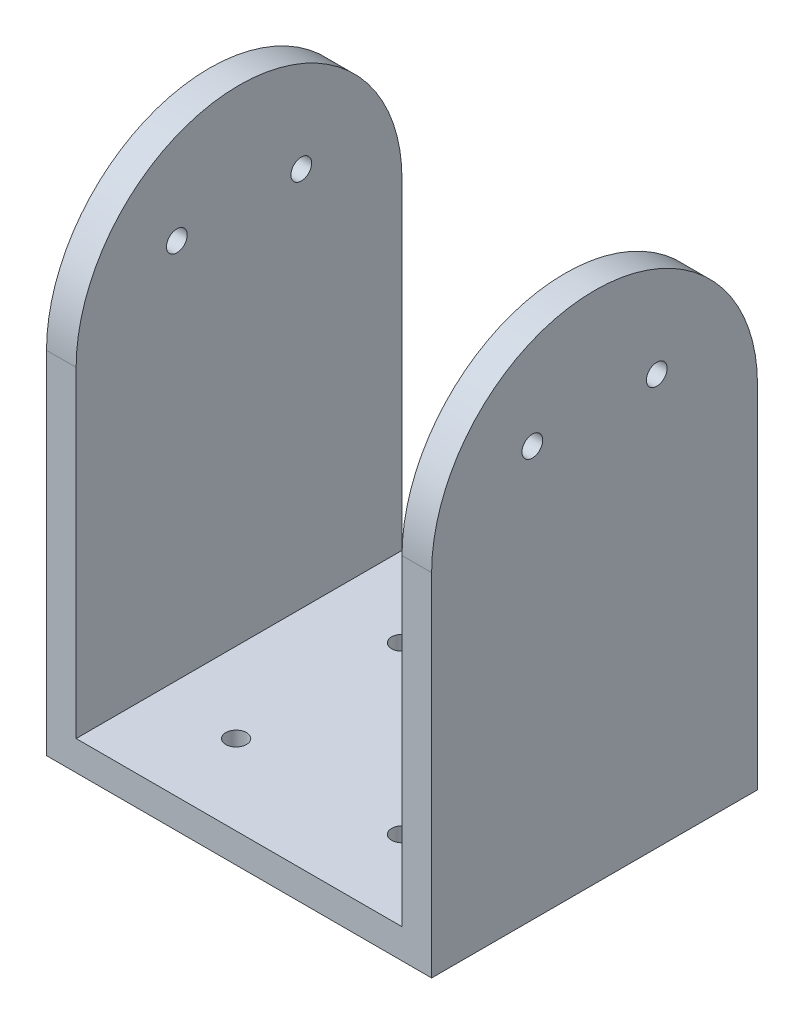
ISO-10303-21;
HEADER;
FILE_DESCRIPTION(('STEP AP214'),'2;1');
FILE_NAME('part.step','',(''),(''),'','','');
FILE_SCHEMA(('AUTOMOTIVE_DESIGN { 1 0 10303 214 1 1 1 1 }'));
ENDSEC;
DATA;
#1=APPLICATION_CONTEXT('core data for automotive mechanical design processes');
#2=APPLICATION_PROTOCOL_DEFINITION('international standard','automotive_design',2000,#1);
#3=PRODUCT_CONTEXT('',#1,'mechanical');
#4=PRODUCT('Part','Part','',(#3));
#5=PRODUCT_RELATED_PRODUCT_CATEGORY('part','',(#4));
#6=PRODUCT_DEFINITION_FORMATION('','',#4);
#7=PRODUCT_DEFINITION_CONTEXT('part definition',#1,'design');
#8=PRODUCT_DEFINITION('design','',#6,#7);
#9=PRODUCT_DEFINITION_SHAPE('','',#8);
#10=(LENGTH_UNIT() NAMED_UNIT(*) SI_UNIT(.MILLI.,.METRE.));
#11=(NAMED_UNIT(*) PLANE_ANGLE_UNIT() SI_UNIT($,.RADIAN.));
#12=(NAMED_UNIT(*) SI_UNIT($,.STERADIAN.) SOLID_ANGLE_UNIT());
#13=UNCERTAINTY_MEASURE_WITH_UNIT(LENGTH_MEASURE(1.E-05),#10,'distance_accuracy_value','');
#14=(GEOMETRIC_REPRESENTATION_CONTEXT(3) GLOBAL_UNCERTAINTY_ASSIGNED_CONTEXT((#13)) GLOBAL_UNIT_ASSIGNED_CONTEXT((#10,
#11,#12)) REPRESENTATION_CONTEXT('',''));
#15=CARTESIAN_POINT('',(0.,0.,0.));
#16=DIRECTION('',(0.,0.,1.));
#17=DIRECTION('',(1.,0.,0.));
#18=AXIS2_PLACEMENT_3D('',#15,#16,#17);
#19=CARTESIAN_POINT('',(32.5,5.,27.5));
#20=DIRECTION('',(-1.,0.,0.));
#21=DIRECTION('',(0.,0.,1.));
#22=AXIS2_PLACEMENT_3D('',#19,#20,#21);
#23=PLANE('',#22);
#24=CARTESIAN_POINT('',(32.5,69.25,10.5));
#25=DIRECTION('',(-1.,0.,0.));
#26=DIRECTION('',(0.,0.,1.));
#27=AXIS2_PLACEMENT_3D('',#24,#25,#26);
#28=CIRCLE('',#27,1.75);
#29=CARTESIAN_POINT('',(32.5,69.25,12.25));
#30=VERTEX_POINT('',#29);
#31=EDGE_CURVE('E243',#30,#30,#28,.F.);
#32=ORIENTED_EDGE('',*,*,#31,.F.);
#33=EDGE_LOOP('',(#32));
#34=FACE_BOUND('',#33,.T.);
#35=CARTESIAN_POINT('',(32.5,59.25,0.));
#36=DIRECTION('',(-1.,0.,0.));
#37=DIRECTION('',(0.,0.,1.));
#38=AXIS2_PLACEMENT_3D('',#35,#36,#37);
#39=CIRCLE('',#38,27.5);
#40=CARTESIAN_POINT('',(32.5,59.25,-27.5));
#41=VERTEX_POINT('',#40);
#42=CARTESIAN_POINT('',(32.5,59.25,27.5));
#43=VERTEX_POINT('',#42);
#44=EDGE_CURVE('E150',#41,#43,#39,.F.);
#45=ORIENTED_EDGE('',*,*,#44,.T.);
#46=DIRECTION('',(0.,-1.,0.));
#47=VECTOR('',#46,1.);
#48=CARTESIAN_POINT('',(32.5,5.,27.5));
#49=LINE('',#48,#47);
#50=CARTESIAN_POINT('',(32.5,0.,27.5));
#51=VERTEX_POINT('',#50);
#52=EDGE_CURVE('E155',#43,#51,#49,.T.);
#53=ORIENTED_EDGE('',*,*,#52,.T.);
#54=DIRECTION('',(0.,0.,-1.));
#55=VECTOR('',#54,1.);
#56=CARTESIAN_POINT('',(32.5,0.,27.5));
#57=LINE('',#56,#55);
#58=CARTESIAN_POINT('',(32.5,0.,-27.5));
#59=VERTEX_POINT('',#58);
#60=EDGE_CURVE('E195',#51,#59,#57,.T.);
#61=ORIENTED_EDGE('',*,*,#60,.T.);
#62=DIRECTION('',(0.,-1.,0.));
#63=VECTOR('',#62,1.);
#64=CARTESIAN_POINT('',(32.5,5.,-27.5));
#65=LINE('',#64,#63);
#66=EDGE_CURVE('E12',#41,#59,#65,.T.);
#67=ORIENTED_EDGE('',*,*,#66,.F.);
#68=EDGE_LOOP('',(#45,#53,#61,#67));
#69=FACE_BOUND('',#68,.T.);
#70=CARTESIAN_POINT('',(32.5,69.25,-10.5));
#71=DIRECTION('',(-1.,0.,0.));
#72=DIRECTION('',(0.,0.,1.));
#73=AXIS2_PLACEMENT_3D('',#70,#71,#72);
#74=CIRCLE('',#73,1.75);
#75=CARTESIAN_POINT('',(32.5,69.25,-8.75));
#76=VERTEX_POINT('',#75);
#77=EDGE_CURVE('E164',#76,#76,#74,.T.);
#78=ORIENTED_EDGE('',*,*,#77,.T.);
#79=EDGE_LOOP('',(#78));
#80=FACE_BOUND('',#79,.T.);
#81=ADVANCED_FACE('F84',(#34,#69,#80),#23,.F.);
#82=CARTESIAN_POINT('',(27.5,86.75,-27.5));
#83=DIRECTION('',(1.,0.,0.));
#84=DIRECTION('',(0.,0.,-1.));
#85=AXIS2_PLACEMENT_3D('',#82,#83,#84);
#86=PLANE('',#85);
#87=CARTESIAN_POINT('',(27.5,69.25,10.5));
#88=DIRECTION('',(1.,0.,0.));
#89=DIRECTION('',(0.,0.,-1.));
#90=AXIS2_PLACEMENT_3D('',#87,#88,#89);
#91=CIRCLE('',#90,1.75);
#92=CARTESIAN_POINT('',(27.5,69.25,8.75000000000001));
#93=VERTEX_POINT('',#92);
#94=EDGE_CURVE('E238',#93,#93,#91,.F.);
#95=ORIENTED_EDGE('',*,*,#94,.F.);
#96=EDGE_LOOP('',(#95));
#97=FACE_BOUND('',#96,.T.);
#98=DIRECTION('',(0.,-1.,0.));
#99=VECTOR('',#98,1.);
#100=CARTESIAN_POINT('',(27.5,86.75,27.5));
#101=LINE('',#100,#99);
#102=CARTESIAN_POINT('',(27.5,59.25,27.5));
#103=VERTEX_POINT('',#102);
#104=CARTESIAN_POINT('',(27.5,5.,27.5));
#105=VERTEX_POINT('',#104);
#106=EDGE_CURVE('E106',#103,#105,#101,.T.);
#107=ORIENTED_EDGE('',*,*,#106,.F.);
#108=CARTESIAN_POINT('',(27.5,59.25,0.));
#109=DIRECTION('',(1.,0.,0.));
#110=DIRECTION('',(0.,0.,-1.));
#111=AXIS2_PLACEMENT_3D('',#108,#109,#110);
#112=CIRCLE('',#111,27.5);
#113=CARTESIAN_POINT('',(27.5,59.25,-27.5));
#114=VERTEX_POINT('',#113);
#115=EDGE_CURVE('E160',#103,#114,#112,.F.);
#116=ORIENTED_EDGE('',*,*,#115,.T.);
#117=DIRECTION('',(0.,-1.,0.));
#118=VECTOR('',#117,1.);
#119=CARTESIAN_POINT('',(27.5,86.75,-27.5));
#120=LINE('',#119,#118);
#121=CARTESIAN_POINT('',(27.5,5.,-27.5));
#122=VERTEX_POINT('',#121);
#123=EDGE_CURVE('E98',#114,#122,#120,.T.);
#124=ORIENTED_EDGE('',*,*,#123,.T.);
#125=DIRECTION('',(0.,0.,1.));
#126=VECTOR('',#125,1.);
#127=CARTESIAN_POINT('',(27.5,5.,-27.5));
#128=LINE('',#127,#126);
#129=EDGE_CURVE('E211',#122,#105,#128,.T.);
#130=ORIENTED_EDGE('',*,*,#129,.T.);
#131=EDGE_LOOP('',(#107,#116,#124,#130));
#132=FACE_BOUND('',#131,.T.);
#133=CARTESIAN_POINT('',(27.5,69.25,-10.5));
#134=DIRECTION('',(1.,0.,0.));
#135=DIRECTION('',(0.,0.,-1.));
#136=AXIS2_PLACEMENT_3D('',#133,#134,#135);
#137=CIRCLE('',#136,1.75);
#138=CARTESIAN_POINT('',(27.5,69.25,-12.25));
#139=VERTEX_POINT('',#138);
#140=EDGE_CURVE('E235',#139,#139,#137,.T.);
#141=ORIENTED_EDGE('',*,*,#140,.T.);
#142=EDGE_LOOP('',(#141));
#143=FACE_BOUND('',#142,.T.);
#144=ADVANCED_FACE('F313',(#97,#132,#143),#86,.F.);
#145=CARTESIAN_POINT('',(-32.5,5.,27.5));
#146=DIRECTION('',(0.,0.,-1.));
#147=DIRECTION('',(-1.,0.,0.));
#148=AXIS2_PLACEMENT_3D('',#145,#146,#147);
#149=PLANE('',#148);
#150=DIRECTION('',(1.,0.,0.));
#151=VECTOR('',#150,1.);
#152=CARTESIAN_POINT('',(-32.501,59.25,27.5));
#153=LINE('',#152,#151);
#154=EDGE_CURVE('E162',#103,#43,#153,.T.);
#155=ORIENTED_EDGE('',*,*,#154,.F.);
#156=ORIENTED_EDGE('',*,*,#106,.T.);
#157=DIRECTION('',(1.,0.,0.));
#158=VECTOR('',#157,1.);
#159=CARTESIAN_POINT('',(-32.5,5.,27.5));
#160=LINE('',#159,#158);
#161=CARTESIAN_POINT('',(-27.5,5.,27.5));
#162=VERTEX_POINT('',#161);
#163=EDGE_CURVE('E171',#162,#105,#160,.T.);
#164=ORIENTED_EDGE('',*,*,#163,.F.);
#165=DIRECTION('',(0.,-1.,0.));
#166=VECTOR('',#165,1.);
#167=CARTESIAN_POINT('',(-27.5,86.75,27.5));
#168=LINE('',#167,#166);
#169=CARTESIAN_POINT('',(-27.5,59.25,27.5));
#170=VERTEX_POINT('',#169);
#171=EDGE_CURVE('E199',#170,#162,#168,.T.);
#172=ORIENTED_EDGE('',*,*,#171,.F.);
#173=DIRECTION('',(-1.,0.,0.));
#174=VECTOR('',#173,1.);
#175=CARTESIAN_POINT('',(32.501,59.25,27.5));
#176=LINE('',#175,#174);
#177=CARTESIAN_POINT('',(-32.5,59.25,27.5));
#178=VERTEX_POINT('',#177);
#179=EDGE_CURVE('E218',#170,#178,#176,.T.);
#180=ORIENTED_EDGE('',*,*,#179,.T.);
#181=DIRECTION('',(0.,-1.,0.));
#182=VECTOR('',#181,1.);
#183=CARTESIAN_POINT('',(-32.5,5.,27.5));
#184=LINE('',#183,#182);
#185=CARTESIAN_POINT('',(-32.5,0.,27.5));
#186=VERTEX_POINT('',#185);
#187=EDGE_CURVE('E170',#178,#186,#184,.T.);
#188=ORIENTED_EDGE('',*,*,#187,.T.);
#189=DIRECTION('',(1.,0.,0.));
#190=VECTOR('',#189,1.);
#191=CARTESIAN_POINT('',(-32.5,0.,27.5));
#192=LINE('',#191,#190);
#193=EDGE_CURVE('E168',#186,#51,#192,.T.);
#194=ORIENTED_EDGE('',*,*,#193,.T.);
#195=ORIENTED_EDGE('',*,*,#52,.F.);
#196=EDGE_LOOP('',(#155,#156,#164,#172,#180,#188,#194,#195));
#197=FACE_BOUND('',#196,.T.);
#198=ADVANCED_FACE('F166',(#197),#149,.F.);
#199=CARTESIAN_POINT('',(-32.5,5.,27.5));
#200=DIRECTION('',(1.,0.,0.));
#201=DIRECTION('',(0.,0.,-1.));
#202=AXIS2_PLACEMENT_3D('',#199,#200,#201);
#203=PLANE('',#202);
#204=CARTESIAN_POINT('',(-32.5,69.25,10.5));
#205=DIRECTION('',(-1.,0.,0.));
#206=DIRECTION('',(0.,0.,1.));
#207=AXIS2_PLACEMENT_3D('',#204,#205,#206);
#208=CIRCLE('',#207,1.75);
#209=CARTESIAN_POINT('',(-32.5,69.25,12.25));
#210=VERTEX_POINT('',#209);
#211=EDGE_CURVE('E228',#210,#210,#208,.F.);
#212=ORIENTED_EDGE('',*,*,#211,.T.);
#213=EDGE_LOOP('',(#212));
#214=FACE_BOUND('',#213,.T.);
#215=ORIENTED_EDGE('',*,*,#187,.F.);
#216=CARTESIAN_POINT('',(-32.5,59.25,0.));
#217=DIRECTION('',(-1.,0.,0.));
#218=DIRECTION('',(0.,0.,1.));
#219=AXIS2_PLACEMENT_3D('',#216,#217,#218);
#220=CIRCLE('',#219,27.5);
#221=CARTESIAN_POINT('',(-32.5,59.25,-27.5));
#222=VERTEX_POINT('',#221);
#223=EDGE_CURVE('E188',#222,#178,#220,.F.);
#224=ORIENTED_EDGE('',*,*,#223,.F.);
#225=DIRECTION('',(0.,-1.,0.));
#226=VECTOR('',#225,1.);
#227=CARTESIAN_POINT('',(-32.5,5.,-27.5));
#228=LINE('',#227,#226);
#229=CARTESIAN_POINT('',(-32.5,0.,-27.5));
#230=VERTEX_POINT('',#229);
#231=EDGE_CURVE('E91',#222,#230,#228,.T.);
#232=ORIENTED_EDGE('',*,*,#231,.T.);
#233=DIRECTION('',(0.,0.,1.));
#234=VECTOR('',#233,1.);
#235=CARTESIAN_POINT('',(-32.5,0.,27.5));
#236=LINE('',#235,#234);
#237=EDGE_CURVE('E187',#230,#186,#236,.T.);
#238=ORIENTED_EDGE('',*,*,#237,.T.);
#239=EDGE_LOOP('',(#215,#224,#232,#238));
#240=FACE_BOUND('',#239,.T.);
#241=CARTESIAN_POINT('',(-32.5,69.25,-10.5));
#242=DIRECTION('',(-1.,0.,0.));
#243=DIRECTION('',(0.,0.,1.));
#244=AXIS2_PLACEMENT_3D('',#241,#242,#243);
#245=CIRCLE('',#244,1.75);
#246=CARTESIAN_POINT('',(-32.5,69.25,-8.75));
#247=VERTEX_POINT('',#246);
#248=EDGE_CURVE('E222',#247,#247,#245,.T.);
#249=ORIENTED_EDGE('',*,*,#248,.F.);
#250=EDGE_LOOP('',(#249));
#251=FACE_BOUND('',#250,.T.);
#252=ADVANCED_FACE('F184',(#214,#240,#251),#203,.F.);
#253=CARTESIAN_POINT('',(-27.5,86.75,-27.5));
#254=DIRECTION('',(-1.,0.,0.));
#255=DIRECTION('',(0.,0.,1.));
#256=AXIS2_PLACEMENT_3D('',#253,#254,#255);
#257=PLANE('',#256);
#258=CARTESIAN_POINT('',(-27.5,69.25,10.5));
#259=DIRECTION('',(-1.,0.,0.));
#260=DIRECTION('',(0.,0.,1.));
#261=AXIS2_PLACEMENT_3D('',#258,#259,#260);
#262=CIRCLE('',#261,1.75);
#263=CARTESIAN_POINT('',(-27.5,69.25,12.25));
#264=VERTEX_POINT('',#263);
#265=EDGE_CURVE('E225',#264,#264,#262,.T.);
#266=ORIENTED_EDGE('',*,*,#265,.T.);
#267=EDGE_LOOP('',(#266));
#268=FACE_BOUND('',#267,.T.);
#269=CARTESIAN_POINT('',(-27.5,59.25,0.));
#270=DIRECTION('',(-1.,0.,0.));
#271=DIRECTION('',(0.,0.,1.));
#272=AXIS2_PLACEMENT_3D('',#269,#270,#271);
#273=CIRCLE('',#272,27.5);
#274=CARTESIAN_POINT('',(-27.5,59.25,-27.5));
#275=VERTEX_POINT('',#274);
#276=EDGE_CURVE('E213',#170,#275,#273,.T.);
#277=ORIENTED_EDGE('',*,*,#276,.F.);
#278=ORIENTED_EDGE('',*,*,#171,.T.);
#279=DIRECTION('',(0.,0.,-1.));
#280=VECTOR('',#279,1.);
#281=CARTESIAN_POINT('',(-27.5,5.,-27.5));
#282=LINE('',#281,#280);
#283=CARTESIAN_POINT('',(-27.5,5.,-27.5));
#284=VERTEX_POINT('',#283);
#285=EDGE_CURVE('E206',#162,#284,#282,.T.);
#286=ORIENTED_EDGE('',*,*,#285,.T.);
#287=DIRECTION('',(0.,-1.,0.));
#288=VECTOR('',#287,1.);
#289=CARTESIAN_POINT('',(-27.5,86.75,-27.5));
#290=LINE('',#289,#288);
#291=EDGE_CURVE('E204',#275,#284,#290,.T.);
#292=ORIENTED_EDGE('',*,*,#291,.F.);
#293=EDGE_LOOP('',(#277,#278,#286,#292));
#294=FACE_BOUND('',#293,.T.);
#295=CARTESIAN_POINT('',(-27.5,69.25,-10.5));
#296=DIRECTION('',(-1.,0.,0.));
#297=DIRECTION('',(0.,0.,1.));
#298=AXIS2_PLACEMENT_3D('',#295,#296,#297);
#299=CIRCLE('',#298,1.75);
#300=CARTESIAN_POINT('',(-27.5,69.25,-8.75));
#301=VERTEX_POINT('',#300);
#302=EDGE_CURVE('E219',#301,#301,#299,.F.);
#303=ORIENTED_EDGE('',*,*,#302,.F.);
#304=EDGE_LOOP('',(#303));
#305=FACE_BOUND('',#304,.T.);
#306=ADVANCED_FACE('F291',(#268,#294,#305),#257,.F.);
#307=CARTESIAN_POINT('',(0.,5.,0.));
#308=DIRECTION('',(0.,-1.,0.));
#309=DIRECTION('',(0.,0.,-1.));
#310=AXIS2_PLACEMENT_3D('',#307,#308,#309);
#311=PLANE('',#310);
#312=CARTESIAN_POINT('',(14.0000000000002,5.,14.));
#313=DIRECTION('',(0.,-1.,0.));
#314=DIRECTION('',(0.,0.,-1.));
#315=AXIS2_PLACEMENT_3D('',#312,#313,#314);
#316=CIRCLE('',#315,1.75);
#317=CARTESIAN_POINT('',(14.0000000000002,5.,12.25));
#318=VERTEX_POINT('',#317);
#319=EDGE_CURVE('E253',#318,#318,#316,.F.);
#320=ORIENTED_EDGE('',*,*,#319,.F.);
#321=EDGE_LOOP('',(#320));
#322=FACE_BOUND('',#321,.T.);
#323=CARTESIAN_POINT('',(14.0000000000002,5.,-14.));
#324=DIRECTION('',(0.,-1.,0.));
#325=DIRECTION('',(0.,0.,-1.));
#326=AXIS2_PLACEMENT_3D('',#323,#324,#325);
#327=CIRCLE('',#326,1.75);
#328=CARTESIAN_POINT('',(14.0000000000002,5.,-15.75));
#329=VERTEX_POINT('',#328);
#330=EDGE_CURVE('E260',#329,#329,#327,.F.);
#331=ORIENTED_EDGE('',*,*,#330,.F.);
#332=EDGE_LOOP('',(#331));
#333=FACE_BOUND('',#332,.T.);
#334=CARTESIAN_POINT('',(-14.0000000000002,5.,-14.));
#335=DIRECTION('',(0.,-1.,0.));
#336=DIRECTION('',(0.,0.,-1.));
#337=AXIS2_PLACEMENT_3D('',#334,#335,#336);
#338=CIRCLE('',#337,1.75);
#339=CARTESIAN_POINT('',(-14.0000000000002,5.,-15.75));
#340=VERTEX_POINT('',#339);
#341=EDGE_CURVE('E252',#340,#340,#338,.F.);
#342=ORIENTED_EDGE('',*,*,#341,.F.);
#343=EDGE_LOOP('',(#342));
#344=FACE_BOUND('',#343,.T.);
#345=CARTESIAN_POINT('',(-14.0000000000002,5.,14.));
#346=DIRECTION('',(0.,-1.,0.));
#347=DIRECTION('',(0.,0.,-1.));
#348=AXIS2_PLACEMENT_3D('',#345,#346,#347);
#349=CIRCLE('',#348,1.75);
#350=CARTESIAN_POINT('',(-14.0000000000002,5.,12.25));
#351=VERTEX_POINT('',#350);
#352=EDGE_CURVE('E246',#351,#351,#349,.F.);
#353=ORIENTED_EDGE('',*,*,#352,.F.);
#354=EDGE_LOOP('',(#353));
#355=FACE_BOUND('',#354,.T.);
#356=ORIENTED_EDGE('',*,*,#129,.F.);
#357=DIRECTION('',(-1.,0.,0.));
#358=VECTOR('',#357,1.);
#359=CARTESIAN_POINT('',(-32.5,5.,-27.5));
#360=LINE('',#359,#358);
#361=EDGE_CURVE('E174',#122,#284,#360,.T.);
#362=ORIENTED_EDGE('',*,*,#361,.T.);
#363=ORIENTED_EDGE('',*,*,#285,.F.);
#364=ORIENTED_EDGE('',*,*,#163,.T.);
#365=EDGE_LOOP('',(#356,#362,#363,#364));
#366=FACE_BOUND('',#365,.T.);
#367=ADVANCED_FACE('F288',(#322,#333,#344,#355,#366),#311,.F.);
#368=CARTESIAN_POINT('',(-32.5,5.,-27.5));
#369=DIRECTION('',(0.,0.,1.));
#370=DIRECTION('',(1.,0.,0.));
#371=AXIS2_PLACEMENT_3D('',#368,#369,#370);
#372=PLANE('',#371);
#373=ORIENTED_EDGE('',*,*,#123,.F.);
#374=DIRECTION('',(1.,0.,0.));
#375=VECTOR('',#374,1.);
#376=CARTESIAN_POINT('',(-32.501,59.25,-27.5));
#377=LINE('',#376,#375);
#378=EDGE_CURVE('E159',#114,#41,#377,.T.);
#379=ORIENTED_EDGE('',*,*,#378,.T.);
#380=ORIENTED_EDGE('',*,*,#66,.T.);
#381=DIRECTION('',(-1.,0.,0.));
#382=VECTOR('',#381,1.);
#383=CARTESIAN_POINT('',(-32.5,0.,-27.5));
#384=LINE('',#383,#382);
#385=EDGE_CURVE('E192',#59,#230,#384,.T.);
#386=ORIENTED_EDGE('',*,*,#385,.T.);
#387=ORIENTED_EDGE('',*,*,#231,.F.);
#388=DIRECTION('',(-1.,0.,0.));
#389=VECTOR('',#388,1.);
#390=CARTESIAN_POINT('',(32.501,59.25,-27.5));
#391=LINE('',#390,#389);
#392=EDGE_CURVE('E215',#275,#222,#391,.T.);
#393=ORIENTED_EDGE('',*,*,#392,.F.);
#394=ORIENTED_EDGE('',*,*,#291,.T.);
#395=ORIENTED_EDGE('',*,*,#361,.F.);
#396=EDGE_LOOP('',(#373,#379,#380,#386,#387,#393,#394,#395));
#397=FACE_BOUND('',#396,.T.);
#398=ADVANCED_FACE('F193',(#397),#372,.F.);
#399=CARTESIAN_POINT('',(0.,0.,0.));
#400=DIRECTION('',(0.,-1.,0.));
#401=DIRECTION('',(0.,0.,-1.));
#402=AXIS2_PLACEMENT_3D('',#399,#400,#401);
#403=PLANE('',#402);
#404=CARTESIAN_POINT('',(14.0000000000002,0.,14.));
#405=DIRECTION('',(0.,-1.,0.));
#406=DIRECTION('',(0.,0.,1.));
#407=AXIS2_PLACEMENT_3D('',#404,#405,#406);
#408=CIRCLE('',#407,1.75);
#409=CARTESIAN_POINT('',(14.0000000000002,0.,12.25));
#410=VERTEX_POINT('',#409);
#411=EDGE_CURVE('E257',#410,#410,#408,.T.);
#412=ORIENTED_EDGE('',*,*,#411,.F.);
#413=EDGE_LOOP('',(#412));
#414=FACE_BOUND('',#413,.T.);
#415=CARTESIAN_POINT('',(14.0000000000002,0.,-14.));
#416=DIRECTION('',(0.,-1.,0.));
#417=DIRECTION('',(0.,0.,-1.));
#418=AXIS2_PLACEMENT_3D('',#415,#416,#417);
#419=CIRCLE('',#418,1.75);
#420=CARTESIAN_POINT('',(14.0000000000002,0.,-15.75));
#421=VERTEX_POINT('',#420);
#422=EDGE_CURVE('E256',#421,#421,#419,.T.);
#423=ORIENTED_EDGE('',*,*,#422,.F.);
#424=EDGE_LOOP('',(#423));
#425=FACE_BOUND('',#424,.T.);
#426=CARTESIAN_POINT('',(-14.0000000000002,0.,-14.));
#427=DIRECTION('',(0.,-1.,0.));
#428=DIRECTION('',(0.,0.,1.));
#429=AXIS2_PLACEMENT_3D('',#426,#427,#428);
#430=CIRCLE('',#429,1.75);
#431=CARTESIAN_POINT('',(-14.0000000000002,0.,-15.75));
#432=VERTEX_POINT('',#431);
#433=EDGE_CURVE('E263',#432,#432,#430,.T.);
#434=ORIENTED_EDGE('',*,*,#433,.F.);
#435=EDGE_LOOP('',(#434));
#436=FACE_BOUND('',#435,.T.);
#437=CARTESIAN_POINT('',(-14.0000000000002,0.,14.));
#438=DIRECTION('',(0.,-1.,0.));
#439=DIRECTION('',(0.,0.,-1.));
#440=AXIS2_PLACEMENT_3D('',#437,#438,#439);
#441=CIRCLE('',#440,1.75);
#442=CARTESIAN_POINT('',(-14.0000000000002,0.,12.25));
#443=VERTEX_POINT('',#442);
#444=EDGE_CURVE('E249',#443,#443,#441,.T.);
#445=ORIENTED_EDGE('',*,*,#444,.F.);
#446=EDGE_LOOP('',(#445));
#447=FACE_BOUND('',#446,.T.);
#448=ORIENTED_EDGE('',*,*,#60,.F.);
#449=ORIENTED_EDGE('',*,*,#193,.F.);
#450=ORIENTED_EDGE('',*,*,#237,.F.);
#451=ORIENTED_EDGE('',*,*,#385,.F.);
#452=EDGE_LOOP('',(#448,#449,#450,#451));
#453=FACE_BOUND('',#452,.T.);
#454=ADVANCED_FACE('F197',(#414,#425,#436,#447,#453),#403,.T.);
#455=CARTESIAN_POINT('',(32.501,59.25,0.));
#456=DIRECTION('',(-1.,0.,0.));
#457=DIRECTION('',(0.,0.,1.));
#458=AXIS2_PLACEMENT_3D('',#455,#456,#457);
#459=CYLINDRICAL_SURFACE('',#458,27.5);
#460=ORIENTED_EDGE('',*,*,#276,.T.);
#461=ORIENTED_EDGE('',*,*,#392,.T.);
#462=ORIENTED_EDGE('',*,*,#223,.T.);
#463=ORIENTED_EDGE('',*,*,#179,.F.);
#464=EDGE_LOOP('',(#460,#461,#462,#463));
#465=FACE_BOUND('',#464,.T.);
#466=ADVANCED_FACE('F276',(#465),#459,.T.);
#467=CARTESIAN_POINT('',(32.501,69.25,-10.5));
#468=DIRECTION('',(-1.,0.,0.));
#469=DIRECTION('',(0.,0.,1.));
#470=AXIS2_PLACEMENT_3D('',#467,#468,#469);
#471=CYLINDRICAL_SURFACE('',#470,1.75);
#472=ORIENTED_EDGE('',*,*,#248,.T.);
#473=EDGE_LOOP('',(#472));
#474=FACE_BOUND('',#473,.T.);
#475=ORIENTED_EDGE('',*,*,#302,.T.);
#476=EDGE_LOOP('',(#475));
#477=FACE_BOUND('',#476,.T.);
#478=ADVANCED_FACE('F303',(#474,#477),#471,.F.);
#479=CARTESIAN_POINT('',(32.501,69.25,10.5));
#480=DIRECTION('',(-1.,0.,0.));
#481=DIRECTION('',(0.,0.,1.));
#482=AXIS2_PLACEMENT_3D('',#479,#480,#481);
#483=CYLINDRICAL_SURFACE('',#482,1.75);
#484=ORIENTED_EDGE('',*,*,#211,.F.);
#485=EDGE_LOOP('',(#484));
#486=FACE_BOUND('',#485,.T.);
#487=ORIENTED_EDGE('',*,*,#265,.F.);
#488=EDGE_LOOP('',(#487));
#489=FACE_BOUND('',#488,.T.);
#490=ADVANCED_FACE('F308',(#486,#489),#483,.F.);
#491=CARTESIAN_POINT('',(-32.501,59.25,0.));
#492=DIRECTION('',(1.,0.,0.));
#493=DIRECTION('',(0.,0.,-1.));
#494=AXIS2_PLACEMENT_3D('',#491,#492,#493);
#495=CYLINDRICAL_SURFACE('',#494,27.5);
#496=ORIENTED_EDGE('',*,*,#115,.F.);
#497=ORIENTED_EDGE('',*,*,#154,.T.);
#498=ORIENTED_EDGE('',*,*,#44,.F.);
#499=ORIENTED_EDGE('',*,*,#378,.F.);
#500=EDGE_LOOP('',(#496,#497,#498,#499));
#501=FACE_BOUND('',#500,.T.);
#502=ADVANCED_FACE('F163',(#501),#495,.T.);
#503=CARTESIAN_POINT('',(-32.501,69.25,-10.5));
#504=DIRECTION('',(1.,0.,0.));
#505=DIRECTION('',(0.,0.,-1.));
#506=AXIS2_PLACEMENT_3D('',#503,#504,#505);
#507=CYLINDRICAL_SURFACE('',#506,1.75);
#508=ORIENTED_EDGE('',*,*,#77,.F.);
#509=EDGE_LOOP('',(#508));
#510=FACE_BOUND('',#509,.T.);
#511=ORIENTED_EDGE('',*,*,#140,.F.);
#512=EDGE_LOOP('',(#511));
#513=FACE_BOUND('',#512,.T.);
#514=ADVANCED_FACE('F323',(#510,#513),#507,.F.);
#515=CARTESIAN_POINT('',(-32.501,69.25,10.5));
#516=DIRECTION('',(1.,0.,0.));
#517=DIRECTION('',(0.,0.,-1.));
#518=AXIS2_PLACEMENT_3D('',#515,#516,#517);
#519=CYLINDRICAL_SURFACE('',#518,1.75);
#520=ORIENTED_EDGE('',*,*,#31,.T.);
#521=EDGE_LOOP('',(#520));
#522=FACE_BOUND('',#521,.T.);
#523=ORIENTED_EDGE('',*,*,#94,.T.);
#524=EDGE_LOOP('',(#523));
#525=FACE_BOUND('',#524,.T.);
#526=ADVANCED_FACE('F284',(#522,#525),#519,.F.);
#527=CARTESIAN_POINT('',(-14.0000000000002,86.751,14.));
#528=DIRECTION('',(0.,-1.,0.));
#529=DIRECTION('',(0.,0.,-1.));
#530=AXIS2_PLACEMENT_3D('',#527,#528,#529);
#531=CYLINDRICAL_SURFACE('',#530,1.75);
#532=CARTESIAN_POINT('',(-14.0000000000002,0.,12.25));
#533=CARTESIAN_POINT('',(-14.0000000000002,0.0520833333333322,12.25));
#534=CARTESIAN_POINT('',(-14.0000000000002,0.104166666666664,12.25));
#535=CARTESIAN_POINT('',(-14.0000000000002,0.208333333333329,12.25));
#536=CARTESIAN_POINT('',(-14.0000000000002,0.260416666666661,12.25));
#537=CARTESIAN_POINT('',(-14.0000000000002,0.36458333333333,12.25));
#538=CARTESIAN_POINT('',(-14.0000000000002,0.416666666666667,12.25));
#539=CARTESIAN_POINT('',(-14.0000000000002,0.520833333333336,12.25));
#540=CARTESIAN_POINT('',(-14.0000000000002,0.572916666666668,12.25));
#541=CARTESIAN_POINT('',(-14.0000000000002,0.677083333333333,12.25));
#542=CARTESIAN_POINT('',(-14.0000000000002,0.729166666666665,12.25));
#543=CARTESIAN_POINT('',(-14.0000000000002,0.833333333333334,12.25));
#544=CARTESIAN_POINT('',(-14.0000000000002,0.885416666666671,12.25));
#545=CARTESIAN_POINT('',(-14.0000000000002,0.98958333333334,12.25));
#546=CARTESIAN_POINT('',(-14.0000000000002,1.04166666666667,12.25));
#547=CARTESIAN_POINT('',(-14.0000000000002,1.14583333333334,12.25));
#548=CARTESIAN_POINT('',(-14.0000000000002,1.19791666666667,12.25));
#549=CARTESIAN_POINT('',(-14.0000000000002,1.30208333333333,12.25));
#550=CARTESIAN_POINT('',(-14.0000000000002,1.35416666666667,12.25));
#551=CARTESIAN_POINT('',(-14.0000000000002,1.45833333333333,12.25));
#552=CARTESIAN_POINT('',(-14.0000000000002,1.51041666666666,12.25));
#553=CARTESIAN_POINT('',(-14.0000000000002,1.61458333333333,12.25));
#554=CARTESIAN_POINT('',(-14.0000000000002,1.66666666666667,12.25));
#555=CARTESIAN_POINT('',(-14.0000000000002,1.77083333333334,12.25));
#556=CARTESIAN_POINT('',(-14.0000000000002,1.82291666666667,12.25));
#557=CARTESIAN_POINT('',(-14.0000000000002,1.92708333333333,12.25));
#558=CARTESIAN_POINT('',(-14.0000000000002,1.97916666666667,12.25));
#559=CARTESIAN_POINT('',(-14.0000000000002,2.08333333333334,12.25));
#560=CARTESIAN_POINT('',(-14.0000000000002,2.13541666666667,12.25));
#561=CARTESIAN_POINT('',(-14.0000000000002,2.23958333333334,12.25));
#562=CARTESIAN_POINT('',(-14.0000000000002,2.29166666666667,12.25));
#563=CARTESIAN_POINT('',(-14.0000000000002,2.39583333333334,12.25));
#564=CARTESIAN_POINT('',(-14.0000000000002,2.44791666666667,12.25));
#565=CARTESIAN_POINT('',(-14.0000000000002,2.55208333333333,12.25));
#566=CARTESIAN_POINT('',(-14.0000000000002,2.60416666666667,12.25));
#567=CARTESIAN_POINT('',(-14.0000000000002,2.70833333333333,12.25));
#568=CARTESIAN_POINT('',(-14.0000000000002,2.76041666666666,12.25));
#569=CARTESIAN_POINT('',(-14.0000000000002,2.86458333333333,12.25));
#570=CARTESIAN_POINT('',(-14.0000000000002,2.91666666666667,12.25));
#571=CARTESIAN_POINT('',(-14.0000000000002,3.02083333333334,12.25));
#572=CARTESIAN_POINT('',(-14.0000000000002,3.07291666666667,12.25));
#573=CARTESIAN_POINT('',(-14.0000000000002,3.17708333333334,12.25));
#574=CARTESIAN_POINT('',(-14.0000000000002,3.22916666666667,12.25));
#575=CARTESIAN_POINT('',(-14.0000000000002,3.33333333333334,12.25));
#576=CARTESIAN_POINT('',(-14.0000000000002,3.38541666666667,12.25));
#577=CARTESIAN_POINT('',(-14.0000000000002,3.48958333333334,12.25));
#578=CARTESIAN_POINT('',(-14.0000000000002,3.54166666666667,12.25));
#579=CARTESIAN_POINT('',(-14.0000000000002,3.64583333333334,12.25));
#580=CARTESIAN_POINT('',(-14.0000000000002,3.69791666666667,12.25));
#581=CARTESIAN_POINT('',(-14.0000000000002,3.80208333333334,12.25));
#582=CARTESIAN_POINT('',(-14.0000000000002,3.85416666666667,12.25));
#583=CARTESIAN_POINT('',(-14.0000000000002,3.95833333333333,12.25));
#584=CARTESIAN_POINT('',(-14.0000000000002,4.01041666666666,12.25));
#585=CARTESIAN_POINT('',(-14.0000000000002,4.11458333333333,12.25));
#586=CARTESIAN_POINT('',(-14.0000000000002,4.16666666666667,12.25));
#587=CARTESIAN_POINT('',(-14.0000000000002,4.27083333333334,12.25));
#588=CARTESIAN_POINT('',(-14.0000000000002,4.32291666666667,12.25));
#589=CARTESIAN_POINT('',(-14.0000000000002,4.42708333333334,12.25));
#590=CARTESIAN_POINT('',(-14.0000000000002,4.47916666666667,12.25));
#591=CARTESIAN_POINT('',(-14.0000000000002,4.58333333333334,12.25));
#592=CARTESIAN_POINT('',(-14.0000000000002,4.63541666666667,12.25));
#593=CARTESIAN_POINT('',(-14.0000000000002,4.73958333333334,12.25));
#594=CARTESIAN_POINT('',(-14.0000000000002,4.79166666666668,12.25));
#595=CARTESIAN_POINT('',(-14.0000000000002,4.89583333333334,12.25));
#596=CARTESIAN_POINT('',(-14.0000000000002,4.94791666666667,12.25));
#597=CARTESIAN_POINT('',(-14.0000000000002,5.,12.25));
#598=B_SPLINE_CURVE_WITH_KNOTS('',3,(#532,#533,#534,#535,#536,#537,#538,#539,#540,#541,#542,
#543,#544,#545,#546,#547,#548,#549,#550,#551,#552,#553,#554,#555,#556,#557,#558,#559,#560,#561,
#562,#563,#564,#565,#566,#567,#568,#569,#570,#571,#572,#573,#574,#575,#576,#577,#578,#579,#580,
#581,#582,#583,#584,#585,#586,#587,#588,#589,#590,#591,#592,#593,#594,#595,#596,#597),
.UNSPECIFIED.,.F.,.F.,(4,2,2,2,2,2,2,2,2,2,2,2,2,2,2,2,2,2,2,2,2,2,2,2,2,2,2,2,2,2,2,2,4),(0.,
0.156249999999997,0.312499999999993,0.468750000000004,0.625000000000001,0.781249999999997,
0.937500000000008,1.09375,1.25,1.40625,1.56249999999999,1.71875,1.875,2.03125,2.18750000000001,
2.34375000000001,2.5,2.65625,2.8125,2.96875000000001,3.125,3.28125,3.43750000000001,
3.59375000000001,3.75,3.90625,4.0625,4.21875000000001,4.375,4.53125,4.68750000000001,
4.84375000000001,5.),.UNSPECIFIED.);
#599=EDGE_CURVE('BSEAM281',#443,#351,#598,.T.);
#600=ORIENTED_EDGE('',*,*,#444,.T.);
#601=ORIENTED_EDGE('',*,*,#352,.T.);
#602=ORIENTED_EDGE('',*,*,#599,.T.);
#603=ORIENTED_EDGE('',*,*,#599,.F.);
#604=EDGE_LOOP('',(#600,#602,#601,#603));
#605=FACE_BOUND('',#604,.T.);
#606=ADVANCED_FACE('F281',(#605),#531,.F.);
#607=CARTESIAN_POINT('',(-14.0000000000002,86.751,-14.));
#608=DIRECTION('',(0.,-1.,0.));
#609=DIRECTION('',(0.,0.,-1.));
#610=AXIS2_PLACEMENT_3D('',#607,#608,#609);
#611=CYLINDRICAL_SURFACE('',#610,1.75);
#612=CARTESIAN_POINT('',(-14.0000000000002,0.,-15.75));
#613=CARTESIAN_POINT('',(-14.0000000000002,0.0520833333333322,-15.75));
#614=CARTESIAN_POINT('',(-14.0000000000002,0.104166666666664,-15.75));
#615=CARTESIAN_POINT('',(-14.0000000000002,0.208333333333329,-15.75));
#616=CARTESIAN_POINT('',(-14.0000000000002,0.260416666666661,-15.75));
#617=CARTESIAN_POINT('',(-14.0000000000002,0.36458333333333,-15.75));
#618=CARTESIAN_POINT('',(-14.0000000000002,0.416666666666667,-15.75));
#619=CARTESIAN_POINT('',(-14.0000000000002,0.520833333333336,-15.75));
#620=CARTESIAN_POINT('',(-14.0000000000002,0.572916666666668,-15.75));
#621=CARTESIAN_POINT('',(-14.0000000000002,0.677083333333333,-15.75));
#622=CARTESIAN_POINT('',(-14.0000000000002,0.729166666666665,-15.75));
#623=CARTESIAN_POINT('',(-14.0000000000002,0.833333333333334,-15.75));
#624=CARTESIAN_POINT('',(-14.0000000000002,0.885416666666671,-15.75));
#625=CARTESIAN_POINT('',(-14.0000000000002,0.98958333333334,-15.75));
#626=CARTESIAN_POINT('',(-14.0000000000002,1.04166666666667,-15.75));
#627=CARTESIAN_POINT('',(-14.0000000000002,1.14583333333334,-15.75));
#628=CARTESIAN_POINT('',(-14.0000000000002,1.19791666666667,-15.75));
#629=CARTESIAN_POINT('',(-14.0000000000002,1.30208333333333,-15.75));
#630=CARTESIAN_POINT('',(-14.0000000000002,1.35416666666667,-15.75));
#631=CARTESIAN_POINT('',(-14.0000000000002,1.45833333333333,-15.75));
#632=CARTESIAN_POINT('',(-14.0000000000002,1.51041666666666,-15.75));
#633=CARTESIAN_POINT('',(-14.0000000000002,1.61458333333333,-15.75));
#634=CARTESIAN_POINT('',(-14.0000000000002,1.66666666666667,-15.75));
#635=CARTESIAN_POINT('',(-14.0000000000002,1.77083333333334,-15.75));
#636=CARTESIAN_POINT('',(-14.0000000000002,1.82291666666667,-15.75));
#637=CARTESIAN_POINT('',(-14.0000000000002,1.92708333333333,-15.75));
#638=CARTESIAN_POINT('',(-14.0000000000002,1.97916666666667,-15.75));
#639=CARTESIAN_POINT('',(-14.0000000000002,2.08333333333334,-15.75));
#640=CARTESIAN_POINT('',(-14.0000000000002,2.13541666666667,-15.75));
#641=CARTESIAN_POINT('',(-14.0000000000002,2.23958333333334,-15.75));
#642=CARTESIAN_POINT('',(-14.0000000000002,2.29166666666667,-15.75));
#643=CARTESIAN_POINT('',(-14.0000000000002,2.39583333333334,-15.75));
#644=CARTESIAN_POINT('',(-14.0000000000002,2.44791666666667,-15.75));
#645=CARTESIAN_POINT('',(-14.0000000000002,2.55208333333333,-15.75));
#646=CARTESIAN_POINT('',(-14.0000000000002,2.60416666666667,-15.75));
#647=CARTESIAN_POINT('',(-14.0000000000002,2.70833333333333,-15.75));
#648=CARTESIAN_POINT('',(-14.0000000000002,2.76041666666666,-15.75));
#649=CARTESIAN_POINT('',(-14.0000000000002,2.86458333333333,-15.75));
#650=CARTESIAN_POINT('',(-14.0000000000002,2.91666666666667,-15.75));
#651=CARTESIAN_POINT('',(-14.0000000000002,3.02083333333334,-15.75));
#652=CARTESIAN_POINT('',(-14.0000000000002,3.07291666666667,-15.75));
#653=CARTESIAN_POINT('',(-14.0000000000002,3.17708333333334,-15.75));
#654=CARTESIAN_POINT('',(-14.0000000000002,3.22916666666667,-15.75));
#655=CARTESIAN_POINT('',(-14.0000000000002,3.33333333333334,-15.75));
#656=CARTESIAN_POINT('',(-14.0000000000002,3.38541666666667,-15.75));
#657=CARTESIAN_POINT('',(-14.0000000000002,3.48958333333334,-15.75));
#658=CARTESIAN_POINT('',(-14.0000000000002,3.54166666666667,-15.75));
#659=CARTESIAN_POINT('',(-14.0000000000002,3.64583333333334,-15.75));
#660=CARTESIAN_POINT('',(-14.0000000000002,3.69791666666667,-15.75));
#661=CARTESIAN_POINT('',(-14.0000000000002,3.80208333333334,-15.75));
#662=CARTESIAN_POINT('',(-14.0000000000002,3.85416666666667,-15.75));
#663=CARTESIAN_POINT('',(-14.0000000000002,3.95833333333333,-15.75));
#664=CARTESIAN_POINT('',(-14.0000000000002,4.01041666666666,-15.75));
#665=CARTESIAN_POINT('',(-14.0000000000002,4.11458333333333,-15.75));
#666=CARTESIAN_POINT('',(-14.0000000000002,4.16666666666667,-15.75));
#667=CARTESIAN_POINT('',(-14.0000000000002,4.27083333333334,-15.75));
#668=CARTESIAN_POINT('',(-14.0000000000002,4.32291666666667,-15.75));
#669=CARTESIAN_POINT('',(-14.0000000000002,4.42708333333334,-15.75));
#670=CARTESIAN_POINT('',(-14.0000000000002,4.47916666666667,-15.75));
#671=CARTESIAN_POINT('',(-14.0000000000002,4.58333333333334,-15.75));
#672=CARTESIAN_POINT('',(-14.0000000000002,4.63541666666667,-15.75));
#673=CARTESIAN_POINT('',(-14.0000000000002,4.73958333333334,-15.75));
#674=CARTESIAN_POINT('',(-14.0000000000002,4.79166666666668,-15.75));
#675=CARTESIAN_POINT('',(-14.0000000000002,4.89583333333334,-15.75));
#676=CARTESIAN_POINT('',(-14.0000000000002,4.94791666666667,-15.75));
#677=CARTESIAN_POINT('',(-14.0000000000002,5.,-15.75));
#678=B_SPLINE_CURVE_WITH_KNOTS('',3,(#612,#613,#614,#615,#616,#617,#618,#619,#620,#621,#622,
#623,#624,#625,#626,#627,#628,#629,#630,#631,#632,#633,#634,#635,#636,#637,#638,#639,#640,#641,
#642,#643,#644,#645,#646,#647,#648,#649,#650,#651,#652,#653,#654,#655,#656,#657,#658,#659,#660,
#661,#662,#663,#664,#665,#666,#667,#668,#669,#670,#671,#672,#673,#674,#675,#676,#677),
.UNSPECIFIED.,.F.,.F.,(4,2,2,2,2,2,2,2,2,2,2,2,2,2,2,2,2,2,2,2,2,2,2,2,2,2,2,2,2,2,2,2,4),(0.,
0.156249999999997,0.312499999999993,0.468750000000004,0.625000000000001,0.781249999999997,
0.937500000000008,1.09375,1.25,1.40625,1.56249999999999,1.71875,1.875,2.03125,2.18750000000001,
2.34375000000001,2.5,2.65625,2.8125,2.96875000000001,3.125,3.28125,3.43750000000001,
3.59375000000001,3.75,3.90625,4.0625,4.21875000000001,4.375,4.53125,4.68750000000001,
4.84375000000001,5.),.UNSPECIFIED.);
#679=EDGE_CURVE('BSEAM271',#432,#340,#678,.T.);
#680=ORIENTED_EDGE('',*,*,#433,.T.);
#681=ORIENTED_EDGE('',*,*,#341,.T.);
#682=ORIENTED_EDGE('',*,*,#679,.T.);
#683=ORIENTED_EDGE('',*,*,#679,.F.);
#684=EDGE_LOOP('',(#680,#682,#681,#683));
#685=FACE_BOUND('',#684,.T.);
#686=ADVANCED_FACE('F271',(#685),#611,.F.);
#687=CARTESIAN_POINT('',(14.0000000000002,86.751,-14.));
#688=DIRECTION('',(0.,-1.,0.));
#689=DIRECTION('',(0.,0.,-1.));
#690=AXIS2_PLACEMENT_3D('',#687,#688,#689);
#691=CYLINDRICAL_SURFACE('',#690,1.75);
#692=CARTESIAN_POINT('',(14.0000000000002,0.,-15.75));
#693=CARTESIAN_POINT('',(14.0000000000002,0.0520833333333322,-15.75));
#694=CARTESIAN_POINT('',(14.0000000000002,0.104166666666664,-15.75));
#695=CARTESIAN_POINT('',(14.0000000000002,0.208333333333329,-15.75));
#696=CARTESIAN_POINT('',(14.0000000000002,0.260416666666661,-15.75));
#697=CARTESIAN_POINT('',(14.0000000000002,0.36458333333333,-15.75));
#698=CARTESIAN_POINT('',(14.0000000000002,0.416666666666667,-15.75));
#699=CARTESIAN_POINT('',(14.0000000000002,0.520833333333336,-15.75));
#700=CARTESIAN_POINT('',(14.0000000000002,0.572916666666668,-15.75));
#701=CARTESIAN_POINT('',(14.0000000000002,0.677083333333333,-15.75));
#702=CARTESIAN_POINT('',(14.0000000000002,0.729166666666665,-15.75));
#703=CARTESIAN_POINT('',(14.0000000000002,0.833333333333334,-15.75));
#704=CARTESIAN_POINT('',(14.0000000000002,0.885416666666671,-15.75));
#705=CARTESIAN_POINT('',(14.0000000000002,0.98958333333334,-15.75));
#706=CARTESIAN_POINT('',(14.0000000000002,1.04166666666667,-15.75));
#707=CARTESIAN_POINT('',(14.0000000000002,1.14583333333334,-15.75));
#708=CARTESIAN_POINT('',(14.0000000000002,1.19791666666667,-15.75));
#709=CARTESIAN_POINT('',(14.0000000000002,1.30208333333333,-15.75));
#710=CARTESIAN_POINT('',(14.0000000000002,1.35416666666667,-15.75));
#711=CARTESIAN_POINT('',(14.0000000000002,1.45833333333333,-15.75));
#712=CARTESIAN_POINT('',(14.0000000000002,1.51041666666666,-15.75));
#713=CARTESIAN_POINT('',(14.0000000000002,1.61458333333333,-15.75));
#714=CARTESIAN_POINT('',(14.0000000000002,1.66666666666667,-15.75));
#715=CARTESIAN_POINT('',(14.0000000000002,1.77083333333334,-15.75));
#716=CARTESIAN_POINT('',(14.0000000000002,1.82291666666667,-15.75));
#717=CARTESIAN_POINT('',(14.0000000000002,1.92708333333333,-15.75));
#718=CARTESIAN_POINT('',(14.0000000000002,1.97916666666667,-15.75));
#719=CARTESIAN_POINT('',(14.0000000000002,2.08333333333334,-15.75));
#720=CARTESIAN_POINT('',(14.0000000000002,2.13541666666667,-15.75));
#721=CARTESIAN_POINT('',(14.0000000000002,2.23958333333334,-15.75));
#722=CARTESIAN_POINT('',(14.0000000000002,2.29166666666667,-15.75));
#723=CARTESIAN_POINT('',(14.0000000000002,2.39583333333334,-15.75));
#724=CARTESIAN_POINT('',(14.0000000000002,2.44791666666667,-15.75));
#725=CARTESIAN_POINT('',(14.0000000000002,2.55208333333333,-15.75));
#726=CARTESIAN_POINT('',(14.0000000000002,2.60416666666667,-15.75));
#727=CARTESIAN_POINT('',(14.0000000000002,2.70833333333333,-15.75));
#728=CARTESIAN_POINT('',(14.0000000000002,2.76041666666666,-15.75));
#729=CARTESIAN_POINT('',(14.0000000000002,2.86458333333333,-15.75));
#730=CARTESIAN_POINT('',(14.0000000000002,2.91666666666667,-15.75));
#731=CARTESIAN_POINT('',(14.0000000000002,3.02083333333334,-15.75));
#732=CARTESIAN_POINT('',(14.0000000000002,3.07291666666667,-15.75));
#733=CARTESIAN_POINT('',(14.0000000000002,3.17708333333334,-15.75));
#734=CARTESIAN_POINT('',(14.0000000000002,3.22916666666667,-15.75));
#735=CARTESIAN_POINT('',(14.0000000000002,3.33333333333334,-15.75));
#736=CARTESIAN_POINT('',(14.0000000000002,3.38541666666667,-15.75));
#737=CARTESIAN_POINT('',(14.0000000000002,3.48958333333334,-15.75));
#738=CARTESIAN_POINT('',(14.0000000000002,3.54166666666667,-15.75));
#739=CARTESIAN_POINT('',(14.0000000000002,3.64583333333334,-15.75));
#740=CARTESIAN_POINT('',(14.0000000000002,3.69791666666667,-15.75));
#741=CARTESIAN_POINT('',(14.0000000000002,3.80208333333334,-15.75));
#742=CARTESIAN_POINT('',(14.0000000000002,3.85416666666667,-15.75));
#743=CARTESIAN_POINT('',(14.0000000000002,3.95833333333333,-15.75));
#744=CARTESIAN_POINT('',(14.0000000000002,4.01041666666666,-15.75));
#745=CARTESIAN_POINT('',(14.0000000000002,4.11458333333333,-15.75));
#746=CARTESIAN_POINT('',(14.0000000000002,4.16666666666667,-15.75));
#747=CARTESIAN_POINT('',(14.0000000000002,4.27083333333334,-15.75));
#748=CARTESIAN_POINT('',(14.0000000000002,4.32291666666667,-15.75));
#749=CARTESIAN_POINT('',(14.0000000000002,4.42708333333334,-15.75));
#750=CARTESIAN_POINT('',(14.0000000000002,4.47916666666667,-15.75));
#751=CARTESIAN_POINT('',(14.0000000000002,4.58333333333334,-15.75));
#752=CARTESIAN_POINT('',(14.0000000000002,4.63541666666667,-15.75));
#753=CARTESIAN_POINT('',(14.0000000000002,4.73958333333334,-15.75));
#754=CARTESIAN_POINT('',(14.0000000000002,4.79166666666668,-15.75));
#755=CARTESIAN_POINT('',(14.0000000000002,4.89583333333334,-15.75));
#756=CARTESIAN_POINT('',(14.0000000000002,4.94791666666667,-15.75));
#757=CARTESIAN_POINT('',(14.0000000000002,5.,-15.75));
#758=B_SPLINE_CURVE_WITH_KNOTS('',3,(#692,#693,#694,#695,#696,#697,#698,#699,#700,#701,#702,
#703,#704,#705,#706,#707,#708,#709,#710,#711,#712,#713,#714,#715,#716,#717,#718,#719,#720,#721,
#722,#723,#724,#725,#726,#727,#728,#729,#730,#731,#732,#733,#734,#735,#736,#737,#738,#739,#740,
#741,#742,#743,#744,#745,#746,#747,#748,#749,#750,#751,#752,#753,#754,#755,#756,#757),
.UNSPECIFIED.,.F.,.F.,(4,2,2,2,2,2,2,2,2,2,2,2,2,2,2,2,2,2,2,2,2,2,2,2,2,2,2,2,2,2,2,2,4),(0.,
0.156249999999997,0.312499999999993,0.468750000000004,0.625000000000001,0.781249999999997,
0.937500000000008,1.09375,1.25,1.40625,1.56249999999999,1.71875,1.875,2.03125,2.18750000000001,
2.34375000000001,2.5,2.65625,2.8125,2.96875000000001,3.125,3.28125,3.43750000000001,
3.59375000000001,3.75,3.90625,4.0625,4.21875000000001,4.375,4.53125,4.68750000000001,
4.84375000000001,5.),.UNSPECIFIED.);
#759=EDGE_CURVE('BSEAM386',#421,#329,#758,.T.);
#760=ORIENTED_EDGE('',*,*,#422,.T.);
#761=ORIENTED_EDGE('',*,*,#330,.T.);
#762=ORIENTED_EDGE('',*,*,#759,.T.);
#763=ORIENTED_EDGE('',*,*,#759,.F.);
#764=EDGE_LOOP('',(#760,#762,#761,#763));
#765=FACE_BOUND('',#764,.T.);
#766=ADVANCED_FACE('F386',(#765),#691,.F.);
#767=CARTESIAN_POINT('',(14.0000000000002,86.751,14.));
#768=DIRECTION('',(0.,-1.,0.));
#769=DIRECTION('',(0.,0.,-1.));
#770=AXIS2_PLACEMENT_3D('',#767,#768,#769);
#771=CYLINDRICAL_SURFACE('',#770,1.75);
#772=CARTESIAN_POINT('',(14.0000000000002,0.,12.25));
#773=CARTESIAN_POINT('',(14.0000000000002,0.0520833333333322,12.25));
#774=CARTESIAN_POINT('',(14.0000000000002,0.104166666666664,12.25));
#775=CARTESIAN_POINT('',(14.0000000000002,0.208333333333329,12.25));
#776=CARTESIAN_POINT('',(14.0000000000002,0.260416666666661,12.25));
#777=CARTESIAN_POINT('',(14.0000000000002,0.36458333333333,12.25));
#778=CARTESIAN_POINT('',(14.0000000000002,0.416666666666667,12.25));
#779=CARTESIAN_POINT('',(14.0000000000002,0.520833333333336,12.25));
#780=CARTESIAN_POINT('',(14.0000000000002,0.572916666666668,12.25));
#781=CARTESIAN_POINT('',(14.0000000000002,0.677083333333333,12.25));
#782=CARTESIAN_POINT('',(14.0000000000002,0.729166666666665,12.25));
#783=CARTESIAN_POINT('',(14.0000000000002,0.833333333333334,12.25));
#784=CARTESIAN_POINT('',(14.0000000000002,0.885416666666671,12.25));
#785=CARTESIAN_POINT('',(14.0000000000002,0.98958333333334,12.25));
#786=CARTESIAN_POINT('',(14.0000000000002,1.04166666666667,12.25));
#787=CARTESIAN_POINT('',(14.0000000000002,1.14583333333334,12.25));
#788=CARTESIAN_POINT('',(14.0000000000002,1.19791666666667,12.25));
#789=CARTESIAN_POINT('',(14.0000000000002,1.30208333333333,12.25));
#790=CARTESIAN_POINT('',(14.0000000000002,1.35416666666667,12.25));
#791=CARTESIAN_POINT('',(14.0000000000002,1.45833333333333,12.25));
#792=CARTESIAN_POINT('',(14.0000000000002,1.51041666666666,12.25));
#793=CARTESIAN_POINT('',(14.0000000000002,1.61458333333333,12.25));
#794=CARTESIAN_POINT('',(14.0000000000002,1.66666666666667,12.25));
#795=CARTESIAN_POINT('',(14.0000000000002,1.77083333333334,12.25));
#796=CARTESIAN_POINT('',(14.0000000000002,1.82291666666667,12.25));
#797=CARTESIAN_POINT('',(14.0000000000002,1.92708333333333,12.25));
#798=CARTESIAN_POINT('',(14.0000000000002,1.97916666666667,12.25));
#799=CARTESIAN_POINT('',(14.0000000000002,2.08333333333334,12.25));
#800=CARTESIAN_POINT('',(14.0000000000002,2.13541666666667,12.25));
#801=CARTESIAN_POINT('',(14.0000000000002,2.23958333333334,12.25));
#802=CARTESIAN_POINT('',(14.0000000000002,2.29166666666667,12.25));
#803=CARTESIAN_POINT('',(14.0000000000002,2.39583333333334,12.25));
#804=CARTESIAN_POINT('',(14.0000000000002,2.44791666666667,12.25));
#805=CARTESIAN_POINT('',(14.0000000000002,2.55208333333333,12.25));
#806=CARTESIAN_POINT('',(14.0000000000002,2.60416666666667,12.25));
#807=CARTESIAN_POINT('',(14.0000000000002,2.70833333333333,12.25));
#808=CARTESIAN_POINT('',(14.0000000000002,2.76041666666666,12.25));
#809=CARTESIAN_POINT('',(14.0000000000002,2.86458333333333,12.25));
#810=CARTESIAN_POINT('',(14.0000000000002,2.91666666666667,12.25));
#811=CARTESIAN_POINT('',(14.0000000000002,3.02083333333334,12.25));
#812=CARTESIAN_POINT('',(14.0000000000002,3.07291666666667,12.25));
#813=CARTESIAN_POINT('',(14.0000000000002,3.17708333333334,12.25));
#814=CARTESIAN_POINT('',(14.0000000000002,3.22916666666667,12.25));
#815=CARTESIAN_POINT('',(14.0000000000002,3.33333333333334,12.25));
#816=CARTESIAN_POINT('',(14.0000000000002,3.38541666666667,12.25));
#817=CARTESIAN_POINT('',(14.0000000000002,3.48958333333334,12.25));
#818=CARTESIAN_POINT('',(14.0000000000002,3.54166666666667,12.25));
#819=CARTESIAN_POINT('',(14.0000000000002,3.64583333333334,12.25));
#820=CARTESIAN_POINT('',(14.0000000000002,3.69791666666667,12.25));
#821=CARTESIAN_POINT('',(14.0000000000002,3.80208333333334,12.25));
#822=CARTESIAN_POINT('',(14.0000000000002,3.85416666666667,12.25));
#823=CARTESIAN_POINT('',(14.0000000000002,3.95833333333333,12.25));
#824=CARTESIAN_POINT('',(14.0000000000002,4.01041666666666,12.25));
#825=CARTESIAN_POINT('',(14.0000000000002,4.11458333333333,12.25));
#826=CARTESIAN_POINT('',(14.0000000000002,4.16666666666667,12.25));
#827=CARTESIAN_POINT('',(14.0000000000002,4.27083333333334,12.25));
#828=CARTESIAN_POINT('',(14.0000000000002,4.32291666666667,12.25));
#829=CARTESIAN_POINT('',(14.0000000000002,4.42708333333334,12.25));
#830=CARTESIAN_POINT('',(14.0000000000002,4.47916666666667,12.25));
#831=CARTESIAN_POINT('',(14.0000000000002,4.58333333333334,12.25));
#832=CARTESIAN_POINT('',(14.0000000000002,4.63541666666667,12.25));
#833=CARTESIAN_POINT('',(14.0000000000002,4.73958333333334,12.25));
#834=CARTESIAN_POINT('',(14.0000000000002,4.79166666666668,12.25));
#835=CARTESIAN_POINT('',(14.0000000000002,4.89583333333334,12.25));
#836=CARTESIAN_POINT('',(14.0000000000002,4.94791666666667,12.25));
#837=CARTESIAN_POINT('',(14.0000000000002,5.,12.25));
#838=B_SPLINE_CURVE_WITH_KNOTS('',3,(#772,#773,#774,#775,#776,#777,#778,#779,#780,#781,#782,
#783,#784,#785,#786,#787,#788,#789,#790,#791,#792,#793,#794,#795,#796,#797,#798,#799,#800,#801,
#802,#803,#804,#805,#806,#807,#808,#809,#810,#811,#812,#813,#814,#815,#816,#817,#818,#819,#820,
#821,#822,#823,#824,#825,#826,#827,#828,#829,#830,#831,#832,#833,#834,#835,#836,#837),
.UNSPECIFIED.,.F.,.F.,(4,2,2,2,2,2,2,2,2,2,2,2,2,2,2,2,2,2,2,2,2,2,2,2,2,2,2,2,2,2,2,2,4),(0.,
0.156249999999997,0.312499999999993,0.468750000000004,0.625000000000001,0.781249999999997,
0.937500000000008,1.09375,1.25,1.40625,1.56249999999999,1.71875,1.875,2.03125,2.18750000000001,
2.34375000000001,2.5,2.65625,2.8125,2.96875000000001,3.125,3.28125,3.43750000000001,
3.59375000000001,3.75,3.90625,4.0625,4.21875000000001,4.375,4.53125,4.68750000000001,
4.84375000000001,5.),.UNSPECIFIED.);
#839=EDGE_CURVE('BSEAM395',#410,#318,#838,.T.);
#840=ORIENTED_EDGE('',*,*,#411,.T.);
#841=ORIENTED_EDGE('',*,*,#319,.T.);
#842=ORIENTED_EDGE('',*,*,#839,.T.);
#843=ORIENTED_EDGE('',*,*,#839,.F.);
#844=EDGE_LOOP('',(#840,#842,#841,#843));
#845=FACE_BOUND('',#844,.T.);
#846=ADVANCED_FACE('F395',(#845),#771,.F.);
#847=CLOSED_SHELL('',(#81,#144,#198,#252,#306,#367,#398,#454,#466,#478,#490,#502,#514,#526,#606,
#686,#766,#846));
#848=MANIFOLD_SOLID_BREP('B2',#847);
#849=ADVANCED_BREP_SHAPE_REPRESENTATION('',(#18,#848),#14);
#850=SHAPE_DEFINITION_REPRESENTATION(#9,#849);
ENDSEC;
END-ISO-10303-21;
